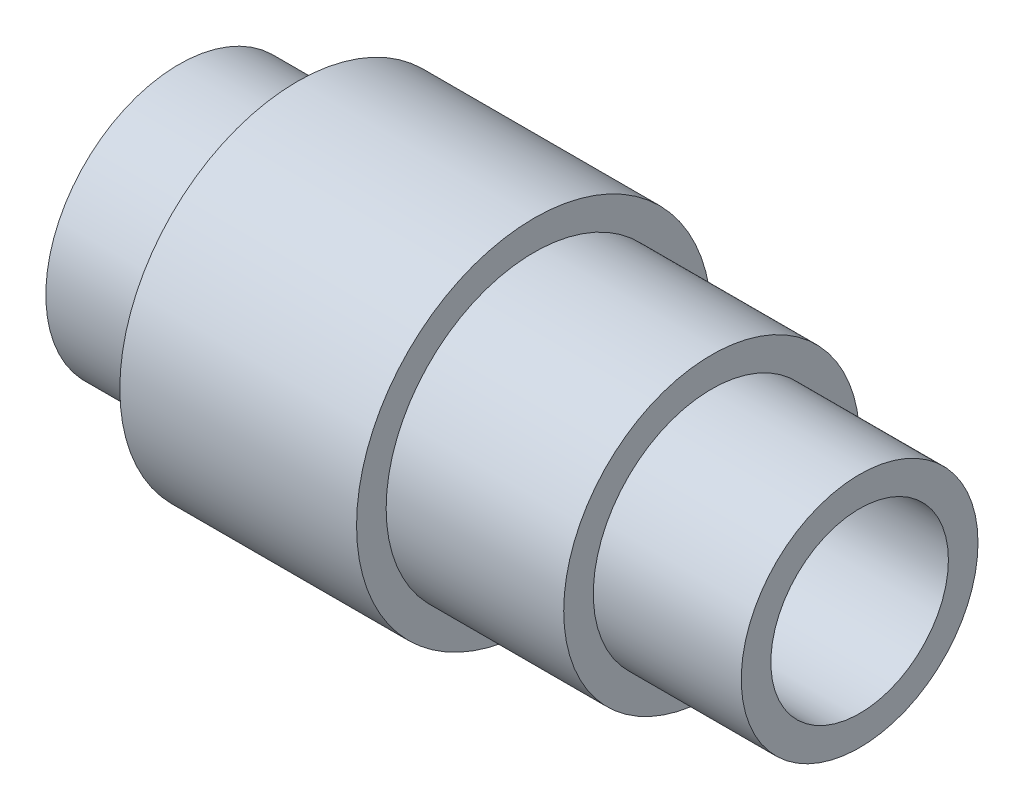
ISO-10303-21;
HEADER;
FILE_DESCRIPTION(('STEP AP214'),'2;1');
FILE_NAME('part.step','',(''),(''),'','','');
FILE_SCHEMA(('AUTOMOTIVE_DESIGN { 1 0 10303 214 1 1 1 1 }'));
ENDSEC;
DATA;
#1=APPLICATION_CONTEXT('core data for automotive mechanical design processes');
#2=APPLICATION_PROTOCOL_DEFINITION('international standard','automotive_design',2000,#1);
#3=PRODUCT_CONTEXT('',#1,'mechanical');
#4=PRODUCT('Part','Part','',(#3));
#5=PRODUCT_RELATED_PRODUCT_CATEGORY('part','',(#4));
#6=PRODUCT_DEFINITION_FORMATION('','',#4);
#7=PRODUCT_DEFINITION_CONTEXT('part definition',#1,'design');
#8=PRODUCT_DEFINITION('design','',#6,#7);
#9=PRODUCT_DEFINITION_SHAPE('','',#8);
#10=(LENGTH_UNIT() NAMED_UNIT(*) SI_UNIT(.MILLI.,.METRE.));
#11=(NAMED_UNIT(*) PLANE_ANGLE_UNIT() SI_UNIT($,.RADIAN.));
#12=(NAMED_UNIT(*) SI_UNIT($,.STERADIAN.) SOLID_ANGLE_UNIT());
#13=UNCERTAINTY_MEASURE_WITH_UNIT(LENGTH_MEASURE(1.E-05),#10,'distance_accuracy_value','');
#14=(GEOMETRIC_REPRESENTATION_CONTEXT(3) GLOBAL_UNCERTAINTY_ASSIGNED_CONTEXT((#13)) GLOBAL_UNIT_ASSIGNED_CONTEXT((#10,
#11,#12)) REPRESENTATION_CONTEXT('',''));
#15=CARTESIAN_POINT('',(0.,0.,0.));
#16=DIRECTION('',(0.,0.,1.));
#17=DIRECTION('',(1.,0.,0.));
#18=AXIS2_PLACEMENT_3D('',#15,#16,#17);
#19=CARTESIAN_POINT('',(20.,0.,0.));
#20=DIRECTION('',(-1.,0.,0.));
#21=DIRECTION('',(0.,0.,1.));
#22=AXIS2_PLACEMENT_3D('',#19,#20,#21);
#23=CYLINDRICAL_SURFACE('',#22,22.5);
#24=CARTESIAN_POINT('',(20.,0.,0.));
#25=DIRECTION('',(1.,0.,0.));
#26=DIRECTION('',(0.,0.,-1.));
#27=AXIS2_PLACEMENT_3D('',#24,#25,#26);
#28=CIRCLE('',#27,22.5);
#29=CARTESIAN_POINT('',(20.,0.,-22.5));
#30=VERTEX_POINT('',#29);
#31=EDGE_CURVE('E51',#30,#30,#28,.T.);
#32=ORIENTED_EDGE('',*,*,#31,.F.);
#33=EDGE_LOOP('',(#32));
#34=FACE_BOUND('',#33,.T.);
#35=CARTESIAN_POINT('',(0.,0.,0.));
#36=DIRECTION('',(1.,0.,0.));
#37=DIRECTION('',(0.,0.,-1.));
#38=AXIS2_PLACEMENT_3D('',#35,#36,#37);
#39=CIRCLE('',#38,22.5);
#40=CARTESIAN_POINT('',(0.,0.,-22.5));
#41=VERTEX_POINT('',#40);
#42=EDGE_CURVE('E40',#41,#41,#39,.T.);
#43=ORIENTED_EDGE('',*,*,#42,.T.);
#44=EDGE_LOOP('',(#43));
#45=FACE_BOUND('',#44,.T.);
#46=ADVANCED_FACE('F37',(#34,#45),#23,.T.);
#47=CARTESIAN_POINT('',(0.,0.,0.));
#48=DIRECTION('',(1.,0.,0.));
#49=DIRECTION('',(0.,0.,-1.));
#50=AXIS2_PLACEMENT_3D('',#47,#48,#49);
#51=PLANE('',#50);
#52=CARTESIAN_POINT('',(0.,0.,0.));
#53=DIRECTION('',(1.,0.,0.));
#54=DIRECTION('',(0.,0.,-1.));
#55=AXIS2_PLACEMENT_3D('',#52,#53,#54);
#56=CIRCLE('',#55,15.);
#57=CARTESIAN_POINT('',(0.,0.,-15.));
#58=VERTEX_POINT('',#57);
#59=EDGE_CURVE('E120',#58,#58,#56,.T.);
#60=ORIENTED_EDGE('',*,*,#59,.T.);
#61=EDGE_LOOP('',(#60));
#62=FACE_BOUND('',#61,.T.);
#63=ORIENTED_EDGE('',*,*,#42,.F.);
#64=EDGE_LOOP('',(#63));
#65=FACE_BOUND('',#64,.T.);
#66=ADVANCED_FACE('F77',(#62,#65),#51,.F.);
#67=CARTESIAN_POINT('',(60.,0.,0.));
#68=DIRECTION('',(-1.,0.,0.));
#69=DIRECTION('',(0.,0.,1.));
#70=AXIS2_PLACEMENT_3D('',#67,#68,#69);
#71=CYLINDRICAL_SURFACE('',#70,30.);
#72=CARTESIAN_POINT('',(60.,0.,0.));
#73=DIRECTION('',(1.,0.,0.));
#74=DIRECTION('',(0.,0.,-1.));
#75=AXIS2_PLACEMENT_3D('',#72,#73,#74);
#76=CIRCLE('',#75,30.);
#77=CARTESIAN_POINT('',(60.,0.,-30.));
#78=VERTEX_POINT('',#77);
#79=EDGE_CURVE('E62',#78,#78,#76,.T.);
#80=ORIENTED_EDGE('',*,*,#79,.F.);
#81=EDGE_LOOP('',(#80));
#82=FACE_BOUND('',#81,.T.);
#83=CARTESIAN_POINT('',(20.,0.,0.));
#84=DIRECTION('',(1.,0.,0.));
#85=DIRECTION('',(0.,0.,-1.));
#86=AXIS2_PLACEMENT_3D('',#83,#84,#85);
#87=CIRCLE('',#86,30.);
#88=CARTESIAN_POINT('',(20.,0.,-30.));
#89=VERTEX_POINT('',#88);
#90=EDGE_CURVE('E60',#89,#89,#87,.T.);
#91=ORIENTED_EDGE('',*,*,#90,.T.);
#92=EDGE_LOOP('',(#91));
#93=FACE_BOUND('',#92,.T.);
#94=ADVANCED_FACE('F79',(#82,#93),#71,.T.);
#95=CARTESIAN_POINT('',(60.,0.,0.));
#96=DIRECTION('',(1.,0.,0.));
#97=DIRECTION('',(0.,0.,-1.));
#98=AXIS2_PLACEMENT_3D('',#95,#96,#97);
#99=PLANE('',#98);
#100=CARTESIAN_POINT('',(60.,0.,0.));
#101=DIRECTION('',(1.,0.,0.));
#102=DIRECTION('',(0.,0.,-1.));
#103=AXIS2_PLACEMENT_3D('',#100,#101,#102);
#104=CIRCLE('',#103,25.);
#105=CARTESIAN_POINT('',(60.,0.,-25.));
#106=VERTEX_POINT('',#105);
#107=EDGE_CURVE('E45',#106,#106,#104,.T.);
#108=ORIENTED_EDGE('',*,*,#107,.F.);
#109=EDGE_LOOP('',(#108));
#110=FACE_BOUND('',#109,.T.);
#111=ORIENTED_EDGE('',*,*,#79,.T.);
#112=EDGE_LOOP('',(#111));
#113=FACE_BOUND('',#112,.T.);
#114=ADVANCED_FACE('F85',(#110,#113),#99,.T.);
#115=CARTESIAN_POINT('',(20.,0.,0.));
#116=DIRECTION('',(1.,0.,0.));
#117=DIRECTION('',(0.,0.,-1.));
#118=AXIS2_PLACEMENT_3D('',#115,#116,#117);
#119=PLANE('',#118);
#120=ORIENTED_EDGE('',*,*,#31,.T.);
#121=EDGE_LOOP('',(#120));
#122=FACE_BOUND('',#121,.T.);
#123=ORIENTED_EDGE('',*,*,#90,.F.);
#124=EDGE_LOOP('',(#123));
#125=FACE_BOUND('',#124,.T.);
#126=ADVANCED_FACE('F91',(#122,#125),#119,.F.);
#127=CARTESIAN_POINT('',(90.,0.,0.));
#128=DIRECTION('',(-1.,0.,0.));
#129=DIRECTION('',(0.,0.,1.));
#130=AXIS2_PLACEMENT_3D('',#127,#128,#129);
#131=CYLINDRICAL_SURFACE('',#130,25.);
#132=CARTESIAN_POINT('',(90.,0.,0.));
#133=DIRECTION('',(1.,0.,0.));
#134=DIRECTION('',(0.,0.,-1.));
#135=AXIS2_PLACEMENT_3D('',#132,#133,#134);
#136=CIRCLE('',#135,25.);
#137=CARTESIAN_POINT('',(90.,0.,-25.));
#138=VERTEX_POINT('',#137);
#139=EDGE_CURVE('E57',#138,#138,#136,.T.);
#140=ORIENTED_EDGE('',*,*,#139,.F.);
#141=EDGE_LOOP('',(#140));
#142=FACE_BOUND('',#141,.T.);
#143=ORIENTED_EDGE('',*,*,#107,.T.);
#144=EDGE_LOOP('',(#143));
#145=FACE_BOUND('',#144,.T.);
#146=ADVANCED_FACE('F94',(#142,#145),#131,.T.);
#147=CARTESIAN_POINT('',(90.,0.,0.));
#148=DIRECTION('',(1.,0.,0.));
#149=DIRECTION('',(0.,0.,-1.));
#150=AXIS2_PLACEMENT_3D('',#147,#148,#149);
#151=PLANE('',#150);
#152=CARTESIAN_POINT('',(90.,0.,0.));
#153=DIRECTION('',(1.,0.,0.));
#154=DIRECTION('',(0.,0.,-1.));
#155=AXIS2_PLACEMENT_3D('',#152,#153,#154);
#156=CIRCLE('',#155,20.);
#157=CARTESIAN_POINT('',(90.,0.,-20.));
#158=VERTEX_POINT('',#157);
#159=EDGE_CURVE('E10',#158,#158,#156,.T.);
#160=ORIENTED_EDGE('',*,*,#159,.F.);
#161=EDGE_LOOP('',(#160));
#162=FACE_BOUND('',#161,.T.);
#163=ORIENTED_EDGE('',*,*,#139,.T.);
#164=EDGE_LOOP('',(#163));
#165=FACE_BOUND('',#164,.T.);
#166=ADVANCED_FACE('F100',(#162,#165),#151,.T.);
#167=CARTESIAN_POINT('',(115.,0.,0.));
#168=DIRECTION('',(-1.,0.,0.));
#169=DIRECTION('',(0.,0.,1.));
#170=AXIS2_PLACEMENT_3D('',#167,#168,#169);
#171=CYLINDRICAL_SURFACE('',#170,20.);
#172=CARTESIAN_POINT('',(115.,0.,0.));
#173=DIRECTION('',(1.,0.,0.));
#174=DIRECTION('',(0.,0.,-1.));
#175=AXIS2_PLACEMENT_3D('',#172,#173,#174);
#176=CIRCLE('',#175,20.);
#177=CARTESIAN_POINT('',(115.,0.,-20.));
#178=VERTEX_POINT('',#177);
#179=EDGE_CURVE('E55',#178,#178,#176,.T.);
#180=ORIENTED_EDGE('',*,*,#179,.F.);
#181=EDGE_LOOP('',(#180));
#182=FACE_BOUND('',#181,.T.);
#183=ORIENTED_EDGE('',*,*,#159,.T.);
#184=EDGE_LOOP('',(#183));
#185=FACE_BOUND('',#184,.T.);
#186=ADVANCED_FACE('F104',(#182,#185),#171,.T.);
#187=CARTESIAN_POINT('',(115.,0.,0.));
#188=DIRECTION('',(1.,0.,0.));
#189=DIRECTION('',(0.,0.,-1.));
#190=AXIS2_PLACEMENT_3D('',#187,#188,#189);
#191=PLANE('',#190);
#192=CARTESIAN_POINT('',(115.,0.,0.));
#193=DIRECTION('',(1.,0.,0.));
#194=DIRECTION('',(0.,0.,-1.));
#195=AXIS2_PLACEMENT_3D('',#192,#193,#194);
#196=CIRCLE('',#195,15.);
#197=CARTESIAN_POINT('',(115.,0.,-15.));
#198=VERTEX_POINT('',#197);
#199=EDGE_CURVE('E123',#198,#198,#196,.T.);
#200=ORIENTED_EDGE('',*,*,#199,.F.);
#201=EDGE_LOOP('',(#200));
#202=FACE_BOUND('',#201,.T.);
#203=ORIENTED_EDGE('',*,*,#179,.T.);
#204=EDGE_LOOP('',(#203));
#205=FACE_BOUND('',#204,.T.);
#206=ADVANCED_FACE('F108',(#202,#205),#191,.T.);
#207=CARTESIAN_POINT('',(0.,0.,0.));
#208=DIRECTION('',(1.,0.,0.));
#209=DIRECTION('',(0.,0.,-1.));
#210=AXIS2_PLACEMENT_3D('',#207,#208,#209);
#211=CYLINDRICAL_SURFACE('',#210,15.);
#212=ORIENTED_EDGE('',*,*,#59,.F.);
#213=EDGE_LOOP('',(#212));
#214=FACE_BOUND('',#213,.T.);
#215=ORIENTED_EDGE('',*,*,#199,.T.);
#216=EDGE_LOOP('',(#215));
#217=FACE_BOUND('',#216,.T.);
#218=ADVANCED_FACE('F112',(#214,#217),#211,.F.);
#219=CLOSED_SHELL('',(#46,#66,#94,#114,#126,#146,#166,#186,#206,#218));
#220=MANIFOLD_SOLID_BREP('B2',#219);
#221=ADVANCED_BREP_SHAPE_REPRESENTATION('',(#18,#220),#14);
#222=SHAPE_DEFINITION_REPRESENTATION(#9,#221);
ENDSEC;
END-ISO-10303-21;
